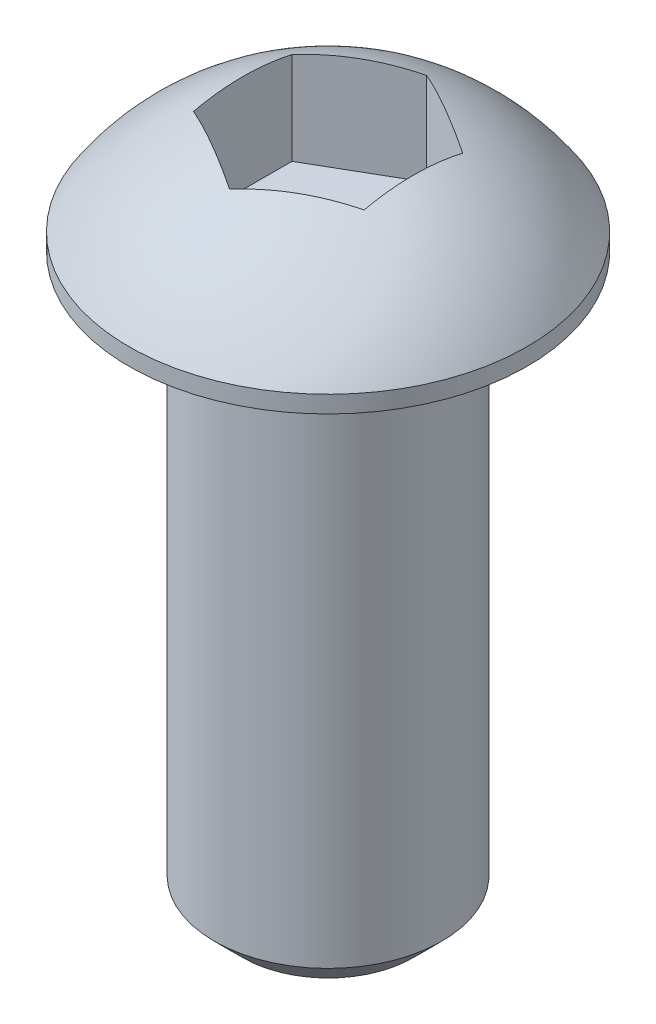
ISO-10303-21;
HEADER;
FILE_DESCRIPTION(('STEP AP214'),'2;1');
FILE_NAME('part.step','',(''),(''),'','','');
FILE_SCHEMA(('AUTOMOTIVE_DESIGN { 1 0 10303 214 1 1 1 1 }'));
ENDSEC;
DATA;
#1=APPLICATION_CONTEXT('core data for automotive mechanical design processes');
#2=APPLICATION_PROTOCOL_DEFINITION('international standard','automotive_design',2000,#1);
#3=PRODUCT_CONTEXT('',#1,'mechanical');
#4=PRODUCT('Part','Part','',(#3));
#5=PRODUCT_RELATED_PRODUCT_CATEGORY('part','',(#4));
#6=PRODUCT_DEFINITION_FORMATION('','',#4);
#7=PRODUCT_DEFINITION_CONTEXT('part definition',#1,'design');
#8=PRODUCT_DEFINITION('design','',#6,#7);
#9=PRODUCT_DEFINITION_SHAPE('','',#8);
#10=(LENGTH_UNIT() NAMED_UNIT(*) SI_UNIT(.MILLI.,.METRE.));
#11=(NAMED_UNIT(*) PLANE_ANGLE_UNIT() SI_UNIT($,.RADIAN.));
#12=(NAMED_UNIT(*) SI_UNIT($,.STERADIAN.) SOLID_ANGLE_UNIT());
#13=UNCERTAINTY_MEASURE_WITH_UNIT(LENGTH_MEASURE(1.E-05),#10,'distance_accuracy_value','');
#14=(GEOMETRIC_REPRESENTATION_CONTEXT(3) GLOBAL_UNCERTAINTY_ASSIGNED_CONTEXT((#13)) GLOBAL_UNIT_ASSIGNED_CONTEXT((#10,
#11,#12)) REPRESENTATION_CONTEXT('',''));
#15=CARTESIAN_POINT('',(0.,0.,0.));
#16=DIRECTION('',(0.,0.,1.));
#17=DIRECTION('',(1.,0.,0.));
#18=AXIS2_PLACEMENT_3D('',#15,#16,#17);
#19=CARTESIAN_POINT('',(0.,-10.,0.));
#20=DIRECTION('',(0.,1.,0.));
#21=DIRECTION('',(0.,0.,1.));
#22=AXIS2_PLACEMENT_3D('',#19,#20,#21);
#23=CYLINDRICAL_SURFACE('',#22,2.);
#24=CARTESIAN_POINT('',(0.,-9.5,0.));
#25=DIRECTION('',(0.,1.,0.));
#26=DIRECTION('',(0.,0.,1.));
#27=AXIS2_PLACEMENT_3D('',#24,#25,#26);
#28=CIRCLE('',#27,2.);
#29=CARTESIAN_POINT('',(0.,-9.5,2.));
#30=VERTEX_POINT('',#29);
#31=EDGE_CURVE('E137',#30,#30,#28,.T.);
#32=ORIENTED_EDGE('',*,*,#31,.T.);
#33=EDGE_LOOP('',(#32));
#34=FACE_BOUND('',#33,.T.);
#35=CARTESIAN_POINT('',(0.,0.,0.));
#36=DIRECTION('',(0.,1.,0.));
#37=DIRECTION('',(0.,0.,1.));
#38=AXIS2_PLACEMENT_3D('',#35,#36,#37);
#39=CIRCLE('',#38,2.);
#40=CARTESIAN_POINT('',(0.,0.,2.));
#41=VERTEX_POINT('',#40);
#42=EDGE_CURVE('E134',#41,#41,#39,.T.);
#43=ORIENTED_EDGE('',*,*,#42,.F.);
#44=EDGE_LOOP('',(#43));
#45=FACE_BOUND('',#44,.T.);
#46=ADVANCED_FACE('F36',(#34,#45),#23,.T.);
#47=CARTESIAN_POINT('',(0.,-10.,0.));
#48=DIRECTION('',(0.,1.,0.));
#49=DIRECTION('',(0.,0.,1.));
#50=AXIS2_PLACEMENT_3D('',#47,#48,#49);
#51=PLANE('',#50);
#52=CARTESIAN_POINT('',(0.,-10.,0.));
#53=DIRECTION('',(0.,1.,0.));
#54=DIRECTION('',(0.,0.,1.));
#55=AXIS2_PLACEMENT_3D('',#52,#53,#54);
#56=CIRCLE('',#55,1.5);
#57=CARTESIAN_POINT('',(0.,-10.,1.5));
#58=VERTEX_POINT('',#57);
#59=EDGE_CURVE('E140',#58,#58,#56,.F.);
#60=ORIENTED_EDGE('',*,*,#59,.T.);
#61=EDGE_LOOP('',(#60));
#62=FACE_BOUND('',#61,.T.);
#63=ADVANCED_FACE('F175',(#62),#51,.F.);
#64=CARTESIAN_POINT('',(-3.5,0.,0.));
#65=DIRECTION('',(0.,1.,0.));
#66=DIRECTION('',(0.,0.,1.));
#67=AXIS2_PLACEMENT_3D('',#64,#65,#66);
#68=PLANE('',#67);
#69=ORIENTED_EDGE('',*,*,#42,.T.);
#70=EDGE_LOOP('',(#69));
#71=FACE_BOUND('',#70,.T.);
#72=CARTESIAN_POINT('',(0.,0.,0.));
#73=DIRECTION('',(0.,-1.,0.));
#74=DIRECTION('',(0.,0.,-1.));
#75=AXIS2_PLACEMENT_3D('',#72,#73,#74);
#76=CIRCLE('',#75,3.5);
#77=CARTESIAN_POINT('',(0.,0.,-3.5));
#78=VERTEX_POINT('',#77);
#79=EDGE_CURVE('E131',#78,#78,#76,.T.);
#80=ORIENTED_EDGE('',*,*,#79,.T.);
#81=EDGE_LOOP('',(#80));
#82=FACE_BOUND('',#81,.T.);
#83=ADVANCED_FACE('F180',(#71,#82),#68,.F.);
#84=CARTESIAN_POINT('',(0.,-2.,0.));
#85=DIRECTION('',(0.,-1.,0.));
#86=DIRECTION('',(0.,0.,-1.));
#87=AXIS2_PLACEMENT_3D('',#84,#85,#86);
#88=CYLINDRICAL_SURFACE('',#87,3.5);
#89=ORIENTED_EDGE('',*,*,#79,.F.);
#90=EDGE_LOOP('',(#89));
#91=FACE_BOUND('',#90,.T.);
#92=CARTESIAN_POINT('',(0.,0.3,0.));
#93=DIRECTION('',(0.,-1.,0.));
#94=DIRECTION('',(0.,0.,-1.));
#95=AXIS2_PLACEMENT_3D('',#92,#93,#94);
#96=CIRCLE('',#95,3.5);
#97=CARTESIAN_POINT('',(0.,0.3,-3.5));
#98=VERTEX_POINT('',#97);
#99=EDGE_CURVE('E119',#98,#98,#96,.T.);
#100=ORIENTED_EDGE('',*,*,#99,.T.);
#101=EDGE_LOOP('',(#100));
#102=FACE_BOUND('',#101,.T.);
#103=ADVANCED_FACE('F187',(#91,#102),#88,.T.);
#104=CARTESIAN_POINT('',(0.,-2.,0.));
#105=DIRECTION('',(0.,-1.,0.));
#106=DIRECTION('',(-1.,0.,0.));
#107=AXIS2_PLACEMENT_3D('',#104,#105,#106);
#108=SPHERICAL_SURFACE('',#107,4.18807831827439);
#109=CARTESIAN_POINT('',(-0.75,-2.,-1.29903810567666));
#110=DIRECTION('',(-0.5,0.,-0.866025403784439));
#111=DIRECTION('',(-0.866025403784439,0.,0.5));
#112=AXIS2_PLACEMENT_3D('',#109,#110,#111);
#113=CIRCLE('',#112,3.91024295920343);
#114=CARTESIAN_POINT('',(-1.5,1.81313519298752,-0.866025403784439));
#115=VERTEX_POINT('',#114);
#116=CARTESIAN_POINT('',(0.,1.81313519298752,-1.73205080756888));
#117=VERTEX_POINT('',#116);
#118=EDGE_CURVE('E143',#115,#117,#113,.T.);
#119=ORIENTED_EDGE('',*,*,#118,.T.);
#120=CARTESIAN_POINT('',(0.749999999999999,-2.,-1.29903810567666));
#121=DIRECTION('',(0.5,0.,-0.866025403784439));
#122=DIRECTION('',(-0.866025403784439,0.,-0.5));
#123=AXIS2_PLACEMENT_3D('',#120,#121,#122);
#124=CIRCLE('',#123,3.91024295920343);
#125=CARTESIAN_POINT('',(1.5,1.81313519298752,-0.866025403784439));
#126=VERTEX_POINT('',#125);
#127=EDGE_CURVE('E11',#117,#126,#124,.T.);
#128=ORIENTED_EDGE('',*,*,#127,.T.);
#129=CARTESIAN_POINT('',(1.5,-2.,0.));
#130=DIRECTION('',(1.,0.,0.));
#131=DIRECTION('',(0.,0.,-1.));
#132=AXIS2_PLACEMENT_3D('',#129,#130,#131);
#133=CIRCLE('',#132,3.91024295920343);
#134=CARTESIAN_POINT('',(1.5,1.81313519298752,0.866025403784438));
#135=VERTEX_POINT('',#134);
#136=EDGE_CURVE('E44',#126,#135,#133,.T.);
#137=ORIENTED_EDGE('',*,*,#136,.T.);
#138=CARTESIAN_POINT('',(0.75,-2.,1.29903810567666));
#139=DIRECTION('',(0.5,0.,0.866025403784439));
#140=DIRECTION('',(0.866025403784439,0.,-0.5));
#141=AXIS2_PLACEMENT_3D('',#138,#139,#140);
#142=CIRCLE('',#141,3.91024295920343);
#143=CARTESIAN_POINT('',(0.,1.81313519298752,1.73205080756888));
#144=VERTEX_POINT('',#143);
#145=EDGE_CURVE('E151',#135,#144,#142,.T.);
#146=ORIENTED_EDGE('',*,*,#145,.T.);
#147=CARTESIAN_POINT('',(-0.75,-2.,1.29903810567666));
#148=DIRECTION('',(-0.5,0.,0.866025403784439));
#149=DIRECTION('',(0.866025403784439,0.,0.5));
#150=AXIS2_PLACEMENT_3D('',#147,#148,#149);
#151=CIRCLE('',#150,3.91024295920343);
#152=CARTESIAN_POINT('',(-1.5,1.81313519298752,0.866025403784439));
#153=VERTEX_POINT('',#152);
#154=EDGE_CURVE('E148',#144,#153,#151,.T.);
#155=ORIENTED_EDGE('',*,*,#154,.T.);
#156=CARTESIAN_POINT('',(-1.5,-2.,0.));
#157=DIRECTION('',(-1.,0.,0.));
#158=DIRECTION('',(0.,0.,1.));
#159=AXIS2_PLACEMENT_3D('',#156,#157,#158);
#160=CIRCLE('',#159,3.91024295920343);
#161=EDGE_CURVE('E145',#153,#115,#160,.T.);
#162=ORIENTED_EDGE('',*,*,#161,.T.);
#163=EDGE_LOOP('',(#119,#128,#137,#146,#155,#162));
#164=FACE_BOUND('',#163,.T.);
#165=ORIENTED_EDGE('',*,*,#99,.F.);
#166=EDGE_LOOP('',(#165));
#167=FACE_BOUND('',#166,.T.);
#168=ADVANCED_FACE('F154',(#164,#167),#108,.T.);
#169=CARTESIAN_POINT('',(0.,-9.5,0.));
#170=DIRECTION('',(0.,1.,0.));
#171=DIRECTION('',(0.,0.,1.));
#172=AXIS2_PLACEMENT_3D('',#169,#170,#171);
#173=CONICAL_SURFACE('',#172,2.,0.78539816339745);
#174=ORIENTED_EDGE('',*,*,#59,.F.);
#175=EDGE_LOOP('',(#174));
#176=FACE_BOUND('',#175,.T.);
#177=ORIENTED_EDGE('',*,*,#31,.F.);
#178=EDGE_LOOP('',(#177));
#179=FACE_BOUND('',#178,.T.);
#180=ADVANCED_FACE('F38',(#176,#179),#173,.T.);
#181=CARTESIAN_POINT('',(1.5,0.188078318274386,-0.866025403784439));
#182=DIRECTION('',(0.5,0.,-0.866025403784439));
#183=DIRECTION('',(-0.866025403784439,0.,-0.5));
#184=AXIS2_PLACEMENT_3D('',#181,#182,#183);
#185=PLANE('',#184);
#186=DIRECTION('',(0.,1.,0.));
#187=VECTOR('',#186,1.);
#188=CARTESIAN_POINT('',(0.,0.188078318274386,-1.73205080756888));
#189=LINE('',#188,#187);
#190=CARTESIAN_POINT('',(0.,0.188078318274386,-1.73205080756888));
#191=VERTEX_POINT('',#190);
#192=EDGE_CURVE('E51',#191,#117,#189,.T.);
#193=ORIENTED_EDGE('',*,*,#192,.F.);
#194=DIRECTION('',(-0.866025403784439,0.,-0.5));
#195=VECTOR('',#194,1.);
#196=CARTESIAN_POINT('',(1.5,0.188078318274386,-0.866025403784439));
#197=LINE('',#196,#195);
#198=CARTESIAN_POINT('',(1.5,0.188078318274386,-0.866025403784439));
#199=VERTEX_POINT('',#198);
#200=EDGE_CURVE('E90',#199,#191,#197,.T.);
#201=ORIENTED_EDGE('',*,*,#200,.F.);
#202=DIRECTION('',(0.,1.,0.));
#203=VECTOR('',#202,1.);
#204=CARTESIAN_POINT('',(1.5,0.188078318274386,-0.866025403784439));
#205=LINE('',#204,#203);
#206=EDGE_CURVE('E117',#199,#126,#205,.T.);
#207=ORIENTED_EDGE('',*,*,#206,.T.);
#208=ORIENTED_EDGE('',*,*,#127,.F.);
#209=EDGE_LOOP('',(#193,#201,#207,#208));
#210=FACE_BOUND('',#209,.T.);
#211=ADVANCED_FACE('F88',(#210),#185,.F.);
#212=CARTESIAN_POINT('',(1.5,0.188078318274386,0.866025403784438));
#213=DIRECTION('',(1.,0.,0.));
#214=DIRECTION('',(0.,0.,-1.));
#215=AXIS2_PLACEMENT_3D('',#212,#213,#214);
#216=PLANE('',#215);
#217=ORIENTED_EDGE('',*,*,#206,.F.);
#218=DIRECTION('',(0.,0.,-1.));
#219=VECTOR('',#218,1.);
#220=CARTESIAN_POINT('',(1.5,0.188078318274386,0.866025403784438));
#221=LINE('',#220,#219);
#222=CARTESIAN_POINT('',(1.5,0.188078318274386,0.866025403784438));
#223=VERTEX_POINT('',#222);
#224=EDGE_CURVE('E94',#223,#199,#221,.T.);
#225=ORIENTED_EDGE('',*,*,#224,.F.);
#226=DIRECTION('',(0.,1.,0.));
#227=VECTOR('',#226,1.);
#228=CARTESIAN_POINT('',(1.5,0.188078318274386,0.866025403784438));
#229=LINE('',#228,#227);
#230=EDGE_CURVE('E120',#223,#135,#229,.T.);
#231=ORIENTED_EDGE('',*,*,#230,.T.);
#232=ORIENTED_EDGE('',*,*,#136,.F.);
#233=EDGE_LOOP('',(#217,#225,#231,#232));
#234=FACE_BOUND('',#233,.T.);
#235=ADVANCED_FACE('F164',(#234),#216,.F.);
#236=CARTESIAN_POINT('',(0.,0.188078318274386,1.73205080756888));
#237=DIRECTION('',(0.5,0.,0.866025403784439));
#238=DIRECTION('',(0.866025403784439,0.,-0.5));
#239=AXIS2_PLACEMENT_3D('',#236,#237,#238);
#240=PLANE('',#239);
#241=ORIENTED_EDGE('',*,*,#230,.F.);
#242=DIRECTION('',(0.866025403784439,0.,-0.5));
#243=VECTOR('',#242,1.);
#244=CARTESIAN_POINT('',(0.,0.188078318274386,1.73205080756888));
#245=LINE('',#244,#243);
#246=CARTESIAN_POINT('',(0.,0.188078318274386,1.73205080756888));
#247=VERTEX_POINT('',#246);
#248=EDGE_CURVE('E114',#247,#223,#245,.T.);
#249=ORIENTED_EDGE('',*,*,#248,.F.);
#250=DIRECTION('',(0.,1.,0.));
#251=VECTOR('',#250,1.);
#252=CARTESIAN_POINT('',(0.,0.188078318274386,1.73205080756888));
#253=LINE('',#252,#251);
#254=EDGE_CURVE('E122',#247,#144,#253,.T.);
#255=ORIENTED_EDGE('',*,*,#254,.T.);
#256=ORIENTED_EDGE('',*,*,#145,.F.);
#257=EDGE_LOOP('',(#241,#249,#255,#256));
#258=FACE_BOUND('',#257,.T.);
#259=ADVANCED_FACE('F163',(#258),#240,.F.);
#260=CARTESIAN_POINT('',(-1.5,0.188078318274386,0.866025403784439));
#261=DIRECTION('',(-0.5,0.,0.866025403784439));
#262=DIRECTION('',(0.866025403784439,0.,0.5));
#263=AXIS2_PLACEMENT_3D('',#260,#261,#262);
#264=PLANE('',#263);
#265=ORIENTED_EDGE('',*,*,#254,.F.);
#266=DIRECTION('',(0.866025403784439,0.,0.5));
#267=VECTOR('',#266,1.);
#268=CARTESIAN_POINT('',(-1.5,0.188078318274386,0.866025403784439));
#269=LINE('',#268,#267);
#270=CARTESIAN_POINT('',(-1.5,0.188078318274386,0.866025403784439));
#271=VERTEX_POINT('',#270);
#272=EDGE_CURVE('E111',#271,#247,#269,.T.);
#273=ORIENTED_EDGE('',*,*,#272,.F.);
#274=DIRECTION('',(0.,1.,0.));
#275=VECTOR('',#274,1.);
#276=CARTESIAN_POINT('',(-1.5,0.188078318274386,0.866025403784439));
#277=LINE('',#276,#275);
#278=EDGE_CURVE('E125',#271,#153,#277,.T.);
#279=ORIENTED_EDGE('',*,*,#278,.T.);
#280=ORIENTED_EDGE('',*,*,#154,.F.);
#281=EDGE_LOOP('',(#265,#273,#279,#280));
#282=FACE_BOUND('',#281,.T.);
#283=ADVANCED_FACE('F161',(#282),#264,.F.);
#284=CARTESIAN_POINT('',(-1.5,0.188078318274386,-0.866025403784438));
#285=DIRECTION('',(-1.,0.,0.));
#286=DIRECTION('',(0.,0.,1.));
#287=AXIS2_PLACEMENT_3D('',#284,#285,#286);
#288=PLANE('',#287);
#289=ORIENTED_EDGE('',*,*,#278,.F.);
#290=DIRECTION('',(0.,0.,1.));
#291=VECTOR('',#290,1.);
#292=CARTESIAN_POINT('',(-1.5,0.188078318274386,-0.866025403784438));
#293=LINE('',#292,#291);
#294=CARTESIAN_POINT('',(-1.5,0.188078318274386,-0.866025403784438));
#295=VERTEX_POINT('',#294);
#296=EDGE_CURVE('E103',#295,#271,#293,.T.);
#297=ORIENTED_EDGE('',*,*,#296,.F.);
#298=DIRECTION('',(0.,1.,0.));
#299=VECTOR('',#298,1.);
#300=CARTESIAN_POINT('',(-1.5,0.188078318274386,-0.866025403784438));
#301=LINE('',#300,#299);
#302=EDGE_CURVE('E93',#295,#115,#301,.T.);
#303=ORIENTED_EDGE('',*,*,#302,.T.);
#304=ORIENTED_EDGE('',*,*,#161,.F.);
#305=EDGE_LOOP('',(#289,#297,#303,#304));
#306=FACE_BOUND('',#305,.T.);
#307=ADVANCED_FACE('F157',(#306),#288,.F.);
#308=CARTESIAN_POINT('',(0.,0.188078318274386,-1.73205080756888));
#309=DIRECTION('',(-0.5,0.,-0.866025403784439));
#310=DIRECTION('',(-0.866025403784439,0.,0.5));
#311=AXIS2_PLACEMENT_3D('',#308,#309,#310);
#312=PLANE('',#311);
#313=ORIENTED_EDGE('',*,*,#302,.F.);
#314=DIRECTION('',(-0.866025403784439,0.,0.5));
#315=VECTOR('',#314,1.);
#316=CARTESIAN_POINT('',(0.,0.188078318274386,-1.73205080756888));
#317=LINE('',#316,#315);
#318=EDGE_CURVE('E97',#191,#295,#317,.T.);
#319=ORIENTED_EDGE('',*,*,#318,.F.);
#320=ORIENTED_EDGE('',*,*,#192,.T.);
#321=ORIENTED_EDGE('',*,*,#118,.F.);
#322=EDGE_LOOP('',(#313,#319,#320,#321));
#323=FACE_BOUND('',#322,.T.);
#324=ADVANCED_FACE('F98',(#323),#312,.F.);
#325=CARTESIAN_POINT('',(0.,0.188078318274386,0.));
#326=DIRECTION('',(0.,1.,0.));
#327=DIRECTION('',(0.,0.,1.));
#328=AXIS2_PLACEMENT_3D('',#325,#326,#327);
#329=PLANE('',#328);
#330=ORIENTED_EDGE('',*,*,#200,.T.);
#331=ORIENTED_EDGE('',*,*,#318,.T.);
#332=ORIENTED_EDGE('',*,*,#296,.T.);
#333=ORIENTED_EDGE('',*,*,#272,.T.);
#334=ORIENTED_EDGE('',*,*,#248,.T.);
#335=ORIENTED_EDGE('',*,*,#224,.T.);
#336=EDGE_LOOP('',(#330,#331,#332,#333,#334,#335));
#337=FACE_BOUND('',#336,.T.);
#338=ADVANCED_FACE('F105',(#337),#329,.T.);
#339=CLOSED_SHELL('',(#46,#63,#83,#103,#168,#180,#211,#235,#259,#283,#307,#324,#338));
#340=MANIFOLD_SOLID_BREP('B2',#339);
#341=ADVANCED_BREP_SHAPE_REPRESENTATION('',(#18,#340),#14);
#342=SHAPE_DEFINITION_REPRESENTATION(#9,#341);
ENDSEC;
END-ISO-10303-21;
